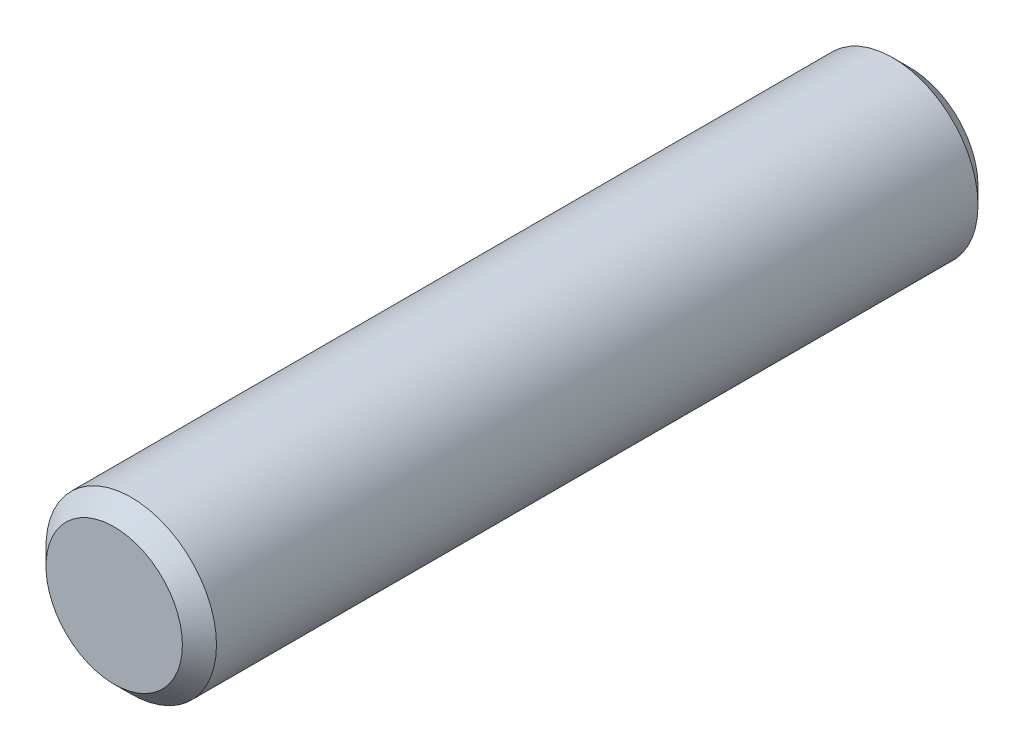
ISO-10303-21;
HEADER;
FILE_DESCRIPTION(('STEP AP214'),'2;1');
FILE_NAME('part.step','',(''),(''),'','','');
FILE_SCHEMA(('AUTOMOTIVE_DESIGN { 1 0 10303 214 1 1 1 1 }'));
ENDSEC;
DATA;
#1=APPLICATION_CONTEXT('core data for automotive mechanical design processes');
#2=APPLICATION_PROTOCOL_DEFINITION('international standard','automotive_design',2000,#1);
#3=PRODUCT_CONTEXT('',#1,'mechanical');
#4=PRODUCT('Part','Part','',(#3));
#5=PRODUCT_RELATED_PRODUCT_CATEGORY('part','',(#4));
#6=PRODUCT_DEFINITION_FORMATION('','',#4);
#7=PRODUCT_DEFINITION_CONTEXT('part definition',#1,'design');
#8=PRODUCT_DEFINITION('design','',#6,#7);
#9=PRODUCT_DEFINITION_SHAPE('','',#8);
#10=(LENGTH_UNIT() NAMED_UNIT(*) SI_UNIT(.MILLI.,.METRE.));
#11=(NAMED_UNIT(*) PLANE_ANGLE_UNIT() SI_UNIT($,.RADIAN.));
#12=(NAMED_UNIT(*) SI_UNIT($,.STERADIAN.) SOLID_ANGLE_UNIT());
#13=UNCERTAINTY_MEASURE_WITH_UNIT(LENGTH_MEASURE(1.E-05),#10,'distance_accuracy_value','');
#14=(GEOMETRIC_REPRESENTATION_CONTEXT(3) GLOBAL_UNCERTAINTY_ASSIGNED_CONTEXT((#13)) GLOBAL_UNIT_ASSIGNED_CONTEXT((#10,
#11,#12)) REPRESENTATION_CONTEXT('',''));
#15=CARTESIAN_POINT('',(0.,0.,0.));
#16=DIRECTION('',(0.,0.,1.));
#17=DIRECTION('',(1.,0.,0.));
#18=AXIS2_PLACEMENT_3D('',#15,#16,#17);
#19=CARTESIAN_POINT('',(0.,0.,7.));
#20=DIRECTION('',(0.,0.,-1.));
#21=DIRECTION('',(-1.,0.,0.));
#22=AXIS2_PLACEMENT_3D('',#19,#20,#21);
#23=CYLINDRICAL_SURFACE('',#22,1.5);
#24=CARTESIAN_POINT('',(0.,0.,-6.7));
#25=DIRECTION('',(0.,0.,1.));
#26=DIRECTION('',(1.,0.,0.));
#27=AXIS2_PLACEMENT_3D('',#24,#25,#26);
#28=CIRCLE('',#27,1.5);
#29=CARTESIAN_POINT('',(1.5,0.,-6.7));
#30=VERTEX_POINT('',#29);
#31=EDGE_CURVE('E53',#30,#30,#28,.T.);
#32=ORIENTED_EDGE('',*,*,#31,.T.);
#33=EDGE_LOOP('',(#32));
#34=FACE_BOUND('',#33,.T.);
#35=CARTESIAN_POINT('',(0.,0.,6.7));
#36=DIRECTION('',(0.,0.,1.));
#37=DIRECTION('',(1.,0.,0.));
#38=AXIS2_PLACEMENT_3D('',#35,#36,#37);
#39=CIRCLE('',#38,1.5);
#40=CARTESIAN_POINT('',(1.5,0.,6.7));
#41=VERTEX_POINT('',#40);
#42=EDGE_CURVE('E58',#41,#41,#39,.F.);
#43=ORIENTED_EDGE('',*,*,#42,.T.);
#44=EDGE_LOOP('',(#43));
#45=FACE_BOUND('',#44,.T.);
#46=ADVANCED_FACE('F39',(#34,#45),#23,.T.);
#47=CARTESIAN_POINT('',(0.,0.,7.));
#48=DIRECTION('',(0.,0.,1.));
#49=DIRECTION('',(1.,0.,0.));
#50=AXIS2_PLACEMENT_3D('',#47,#48,#49);
#51=PLANE('',#50);
#52=CARTESIAN_POINT('',(0.,0.,7.));
#53=DIRECTION('',(0.,0.,1.));
#54=DIRECTION('',(1.,0.,0.));
#55=AXIS2_PLACEMENT_3D('',#52,#53,#54);
#56=CIRCLE('',#55,1.2);
#57=CARTESIAN_POINT('',(1.2,0.,7.));
#58=VERTEX_POINT('',#57);
#59=EDGE_CURVE('E10',#58,#58,#56,.T.);
#60=ORIENTED_EDGE('',*,*,#59,.T.);
#61=EDGE_LOOP('',(#60));
#62=FACE_BOUND('',#61,.T.);
#63=ADVANCED_FACE('F75',(#62),#51,.T.);
#64=CARTESIAN_POINT('',(0.,0.,-7.));
#65=DIRECTION('',(0.,0.,1.));
#66=DIRECTION('',(1.,0.,0.));
#67=AXIS2_PLACEMENT_3D('',#64,#65,#66);
#68=PLANE('',#67);
#69=CARTESIAN_POINT('',(0.,0.,-7.));
#70=DIRECTION('',(0.,0.,1.));
#71=DIRECTION('',(1.,0.,0.));
#72=AXIS2_PLACEMENT_3D('',#69,#70,#71);
#73=CIRCLE('',#72,1.2);
#74=CARTESIAN_POINT('',(1.2,0.,-7.));
#75=VERTEX_POINT('',#74);
#76=EDGE_CURVE('E48',#75,#75,#73,.F.);
#77=ORIENTED_EDGE('',*,*,#76,.T.);
#78=EDGE_LOOP('',(#77));
#79=FACE_BOUND('',#78,.T.);
#80=ADVANCED_FACE('F72',(#79),#68,.F.);
#81=CARTESIAN_POINT('',(0.,0.,-6.7));
#82=DIRECTION('',(0.,0.,1.));
#83=DIRECTION('',(1.,0.,0.));
#84=AXIS2_PLACEMENT_3D('',#81,#82,#83);
#85=CONICAL_SURFACE('',#84,1.5,0.785398163397449);
#86=ORIENTED_EDGE('',*,*,#76,.F.);
#87=EDGE_LOOP('',(#86));
#88=FACE_BOUND('',#87,.T.);
#89=ORIENTED_EDGE('',*,*,#31,.F.);
#90=EDGE_LOOP('',(#89));
#91=FACE_BOUND('',#90,.T.);
#92=ADVANCED_FACE('F68',(#88,#91),#85,.T.);
#93=CARTESIAN_POINT('',(0.,0.,7.));
#94=DIRECTION('',(0.,0.,-1.));
#95=DIRECTION('',(-1.,0.,0.));
#96=AXIS2_PLACEMENT_3D('',#93,#94,#95);
#97=CONICAL_SURFACE('',#96,1.2,0.785398163397448);
#98=ORIENTED_EDGE('',*,*,#42,.F.);
#99=EDGE_LOOP('',(#98));
#100=FACE_BOUND('',#99,.T.);
#101=ORIENTED_EDGE('',*,*,#59,.F.);
#102=EDGE_LOOP('',(#101));
#103=FACE_BOUND('',#102,.T.);
#104=ADVANCED_FACE('F42',(#100,#103),#97,.T.);
#105=CLOSED_SHELL('',(#46,#63,#80,#92,#104));
#106=MANIFOLD_SOLID_BREP('B2',#105);
#107=ADVANCED_BREP_SHAPE_REPRESENTATION('',(#18,#106),#14);
#108=SHAPE_DEFINITION_REPRESENTATION(#9,#107);
ENDSEC;
END-ISO-10303-21;
